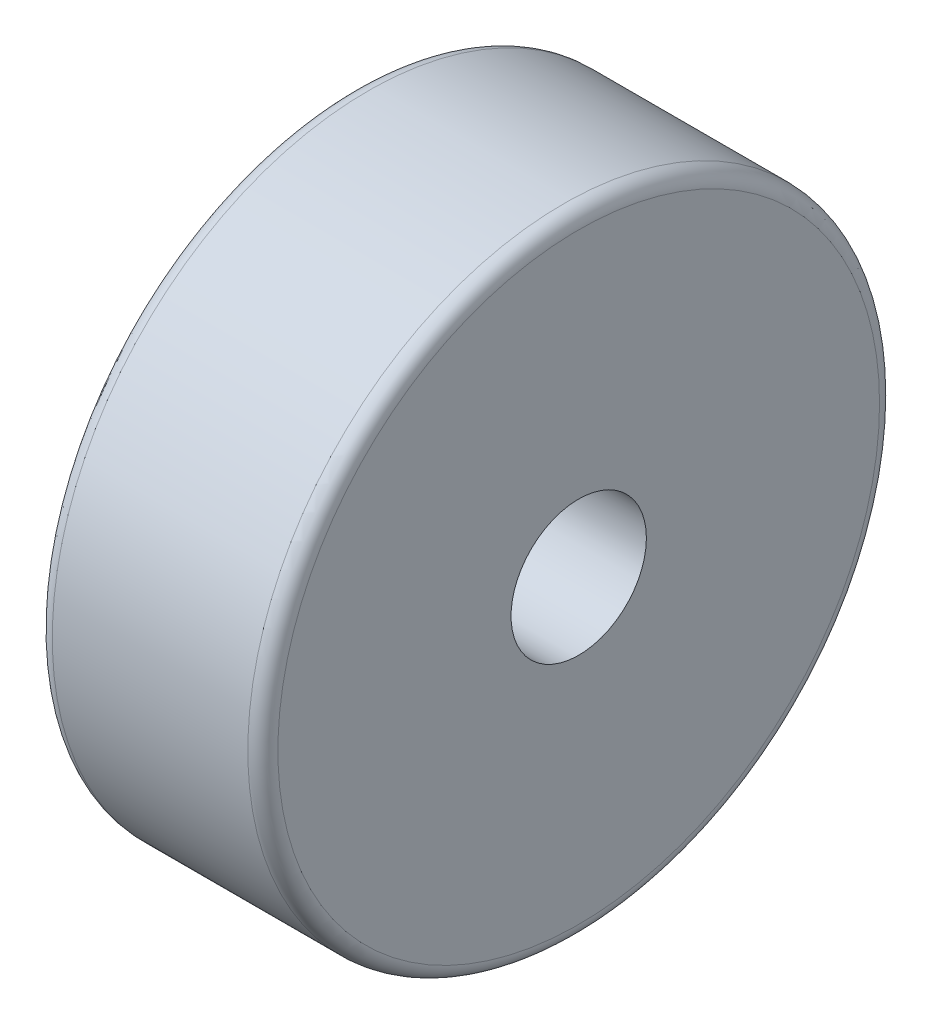
ISO-10303-21;
HEADER;
FILE_DESCRIPTION(('STEP AP214'),'2;1');
FILE_NAME('part.step','',(''),(''),'','','');
FILE_SCHEMA(('AUTOMOTIVE_DESIGN { 1 0 10303 214 1 1 1 1 }'));
ENDSEC;
DATA;
#1=APPLICATION_CONTEXT('core data for automotive mechanical design processes');
#2=APPLICATION_PROTOCOL_DEFINITION('international standard','automotive_design',2000,#1);
#3=PRODUCT_CONTEXT('',#1,'mechanical');
#4=PRODUCT('Part','Part','',(#3));
#5=PRODUCT_RELATED_PRODUCT_CATEGORY('part','',(#4));
#6=PRODUCT_DEFINITION_FORMATION('','',#4);
#7=PRODUCT_DEFINITION_CONTEXT('part definition',#1,'design');
#8=PRODUCT_DEFINITION('design','',#6,#7);
#9=PRODUCT_DEFINITION_SHAPE('','',#8);
#10=(LENGTH_UNIT() NAMED_UNIT(*) SI_UNIT(.MILLI.,.METRE.));
#11=(NAMED_UNIT(*) PLANE_ANGLE_UNIT() SI_UNIT($,.RADIAN.));
#12=(NAMED_UNIT(*) SI_UNIT($,.STERADIAN.) SOLID_ANGLE_UNIT());
#13=UNCERTAINTY_MEASURE_WITH_UNIT(LENGTH_MEASURE(1.E-05),#10,'distance_accuracy_value','');
#14=(GEOMETRIC_REPRESENTATION_CONTEXT(3) GLOBAL_UNCERTAINTY_ASSIGNED_CONTEXT((#13)) GLOBAL_UNIT_ASSIGNED_CONTEXT((#10,
#11,#12)) REPRESENTATION_CONTEXT('',''));
#15=CARTESIAN_POINT('',(0.,0.,0.));
#16=DIRECTION('',(0.,0.,1.));
#17=DIRECTION('',(1.,0.,0.));
#18=AXIS2_PLACEMENT_3D('',#15,#16,#17);
#19=CARTESIAN_POINT('',(-15.,0.,0.));
#20=DIRECTION('',(1.,0.,0.));
#21=DIRECTION('',(0.,0.,-1.));
#22=AXIS2_PLACEMENT_3D('',#19,#20,#21);
#23=CYLINDRICAL_SURFACE('',#22,21.);
#24=CARTESIAN_POINT('',(-14.,0.,0.));
#25=DIRECTION('',(1.,0.,0.));
#26=DIRECTION('',(0.,0.,-1.));
#27=AXIS2_PLACEMENT_3D('',#24,#25,#26);
#28=CIRCLE('',#27,21.);
#29=CARTESIAN_POINT('',(-14.,0.,-21.));
#30=VERTEX_POINT('',#29);
#31=EDGE_CURVE('E42',#30,#30,#28,.T.);
#32=ORIENTED_EDGE('',*,*,#31,.T.);
#33=EDGE_LOOP('',(#32));
#34=FACE_BOUND('',#33,.T.);
#35=CARTESIAN_POINT('',(-1.,0.,0.));
#36=DIRECTION('',(1.,0.,0.));
#37=DIRECTION('',(0.,0.,-1.));
#38=AXIS2_PLACEMENT_3D('',#35,#36,#37);
#39=CIRCLE('',#38,21.);
#40=CARTESIAN_POINT('',(-1.,0.,-21.));
#41=VERTEX_POINT('',#40);
#42=EDGE_CURVE('E46',#41,#41,#39,.F.);
#43=ORIENTED_EDGE('',*,*,#42,.T.);
#44=EDGE_LOOP('',(#43));
#45=FACE_BOUND('',#44,.T.);
#46=ADVANCED_FACE('F31',(#34,#45),#23,.T.);
#47=CARTESIAN_POINT('',(-15.,0.,0.));
#48=DIRECTION('',(1.,0.,0.));
#49=DIRECTION('',(0.,0.,-1.));
#50=AXIS2_PLACEMENT_3D('',#47,#48,#49);
#51=PLANE('',#50);
#52=CARTESIAN_POINT('',(-15.,0.,0.));
#53=DIRECTION('',(1.,0.,0.));
#54=DIRECTION('',(0.,0.,-1.));
#55=AXIS2_PLACEMENT_3D('',#52,#53,#54);
#56=CIRCLE('',#55,4.5);
#57=CARTESIAN_POINT('',(-15.,0.,-4.5));
#58=VERTEX_POINT('',#57);
#59=EDGE_CURVE('E51',#58,#58,#56,.T.);
#60=ORIENTED_EDGE('',*,*,#59,.T.);
#61=EDGE_LOOP('',(#60));
#62=FACE_BOUND('',#61,.T.);
#63=CARTESIAN_POINT('',(-15.,0.,0.));
#64=DIRECTION('',(1.,0.,0.));
#65=DIRECTION('',(0.,0.,-1.));
#66=AXIS2_PLACEMENT_3D('',#63,#64,#65);
#67=CIRCLE('',#66,20.);
#68=CARTESIAN_POINT('',(-15.,0.,-20.));
#69=VERTEX_POINT('',#68);
#70=EDGE_CURVE('E38',#69,#69,#67,.F.);
#71=ORIENTED_EDGE('',*,*,#70,.T.);
#72=EDGE_LOOP('',(#71));
#73=FACE_BOUND('',#72,.T.);
#74=ADVANCED_FACE('F58',(#62,#73),#51,.F.);
#75=CARTESIAN_POINT('',(0.,0.,0.));
#76=DIRECTION('',(1.,0.,0.));
#77=DIRECTION('',(0.,0.,-1.));
#78=AXIS2_PLACEMENT_3D('',#75,#76,#77);
#79=PLANE('',#78);
#80=CARTESIAN_POINT('',(0.,0.,0.));
#81=DIRECTION('',(1.,0.,0.));
#82=DIRECTION('',(0.,0.,-1.));
#83=AXIS2_PLACEMENT_3D('',#80,#81,#82);
#84=CIRCLE('',#83,4.5);
#85=CARTESIAN_POINT('',(0.,0.,-4.5));
#86=VERTEX_POINT('',#85);
#87=EDGE_CURVE('E52',#86,#86,#84,.T.);
#88=ORIENTED_EDGE('',*,*,#87,.F.);
#89=EDGE_LOOP('',(#88));
#90=FACE_BOUND('',#89,.T.);
#91=CARTESIAN_POINT('',(0.,0.,0.));
#92=DIRECTION('',(1.,0.,0.));
#93=DIRECTION('',(0.,0.,-1.));
#94=AXIS2_PLACEMENT_3D('',#91,#92,#93);
#95=CIRCLE('',#94,20.);
#96=CARTESIAN_POINT('',(0.,0.,-20.));
#97=VERTEX_POINT('',#96);
#98=EDGE_CURVE('E10',#97,#97,#95,.T.);
#99=ORIENTED_EDGE('',*,*,#98,.T.);
#100=EDGE_LOOP('',(#99));
#101=FACE_BOUND('',#100,.T.);
#102=ADVANCED_FACE('F66',(#90,#101),#79,.T.);
#103=CARTESIAN_POINT('',(-14.,0.,0.));
#104=DIRECTION('',(1.,0.,0.));
#105=DIRECTION('',(0.,0.,-1.));
#106=AXIS2_PLACEMENT_3D('',#103,#104,#105);
#107=TOROIDAL_SURFACE('',#106,20.,1.);
#108=ORIENTED_EDGE('',*,*,#70,.F.);
#109=EDGE_LOOP('',(#108));
#110=FACE_BOUND('',#109,.T.);
#111=ORIENTED_EDGE('',*,*,#31,.F.);
#112=EDGE_LOOP('',(#111));
#113=FACE_BOUND('',#112,.T.);
#114=ADVANCED_FACE('F68',(#110,#113),#107,.T.);
#115=CARTESIAN_POINT('',(-1.,0.,0.));
#116=DIRECTION('',(1.,0.,0.));
#117=DIRECTION('',(0.,0.,-1.));
#118=AXIS2_PLACEMENT_3D('',#115,#116,#117);
#119=TOROIDAL_SURFACE('',#118,20.,1.);
#120=ORIENTED_EDGE('',*,*,#42,.F.);
#121=EDGE_LOOP('',(#120));
#122=FACE_BOUND('',#121,.T.);
#123=ORIENTED_EDGE('',*,*,#98,.F.);
#124=EDGE_LOOP('',(#123));
#125=FACE_BOUND('',#124,.T.);
#126=ADVANCED_FACE('F33',(#122,#125),#119,.T.);
#127=CARTESIAN_POINT('',(-15.,0.,0.));
#128=DIRECTION('',(1.,0.,0.));
#129=DIRECTION('',(0.,0.,-1.));
#130=AXIS2_PLACEMENT_3D('',#127,#128,#129);
#131=CYLINDRICAL_SURFACE('',#130,4.5);
#132=ORIENTED_EDGE('',*,*,#59,.F.);
#133=EDGE_LOOP('',(#132));
#134=FACE_BOUND('',#133,.T.);
#135=ORIENTED_EDGE('',*,*,#87,.T.);
#136=EDGE_LOOP('',(#135));
#137=FACE_BOUND('',#136,.T.);
#138=ADVANCED_FACE('F60',(#134,#137),#131,.F.);
#139=CLOSED_SHELL('',(#46,#74,#102,#114,#126,#138));
#140=MANIFOLD_SOLID_BREP('B2',#139);
#141=ADVANCED_BREP_SHAPE_REPRESENTATION('',(#18,#140),#14);
#142=SHAPE_DEFINITION_REPRESENTATION(#9,#141);
ENDSEC;
END-ISO-10303-21;
